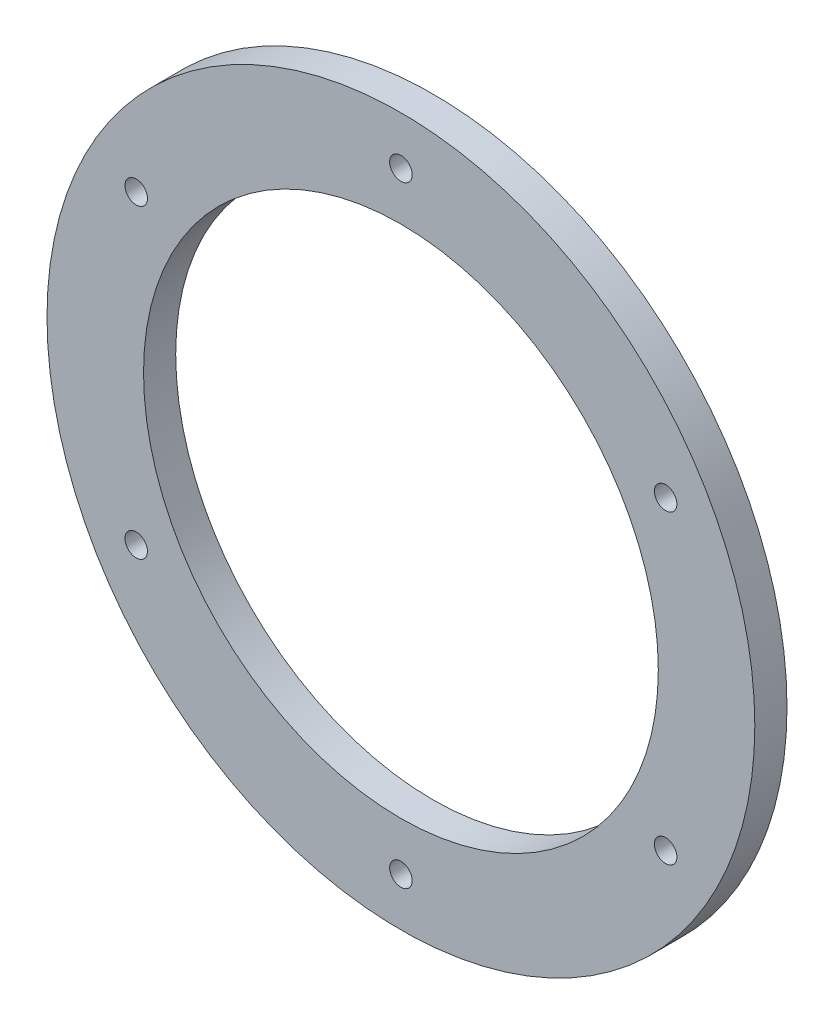
ISO-10303-21;
HEADER;
FILE_DESCRIPTION(('STEP AP214'),'2;1');
FILE_NAME('part.step','',(''),(''),'','','');
FILE_SCHEMA(('AUTOMOTIVE_DESIGN { 1 0 10303 214 1 1 1 1 }'));
ENDSEC;
DATA;
#1=APPLICATION_CONTEXT('core data for automotive mechanical design processes');
#2=APPLICATION_PROTOCOL_DEFINITION('international standard','automotive_design',2000,#1);
#3=PRODUCT_CONTEXT('',#1,'mechanical');
#4=PRODUCT('Part','Part','',(#3));
#5=PRODUCT_RELATED_PRODUCT_CATEGORY('part','',(#4));
#6=PRODUCT_DEFINITION_FORMATION('','',#4);
#7=PRODUCT_DEFINITION_CONTEXT('part definition',#1,'design');
#8=PRODUCT_DEFINITION('design','',#6,#7);
#9=PRODUCT_DEFINITION_SHAPE('','',#8);
#10=(LENGTH_UNIT() NAMED_UNIT(*) SI_UNIT(.MILLI.,.METRE.));
#11=(NAMED_UNIT(*) PLANE_ANGLE_UNIT() SI_UNIT($,.RADIAN.));
#12=(NAMED_UNIT(*) SI_UNIT($,.STERADIAN.) SOLID_ANGLE_UNIT());
#13=UNCERTAINTY_MEASURE_WITH_UNIT(LENGTH_MEASURE(1.E-05),#10,'distance_accuracy_value','');
#14=(GEOMETRIC_REPRESENTATION_CONTEXT(3) GLOBAL_UNCERTAINTY_ASSIGNED_CONTEXT((#13)) GLOBAL_UNIT_ASSIGNED_CONTEXT((#10,
#11,#12)) REPRESENTATION_CONTEXT('',''));
#15=CARTESIAN_POINT('',(0.,0.,0.));
#16=DIRECTION('',(0.,0.,1.));
#17=DIRECTION('',(1.,0.,0.));
#18=AXIS2_PLACEMENT_3D('',#15,#16,#17);
#19=CARTESIAN_POINT('',(0.,0.,5.));
#20=DIRECTION('',(0.,0.,1.));
#21=DIRECTION('',(1.,0.,0.));
#22=AXIS2_PLACEMENT_3D('',#19,#20,#21);
#23=PLANE('',#22);
#24=CARTESIAN_POINT('',(-41.1362066797553,-23.7500000000032,5.));
#25=DIRECTION('',(0.,0.,1.));
#26=DIRECTION('',(1.,0.,0.));
#27=AXIS2_PLACEMENT_3D('',#24,#25,#26);
#28=CIRCLE('',#27,1.75000000000669);
#29=CARTESIAN_POINT('',(-39.3862066797486,-23.7500000000032,5.));
#30=VERTEX_POINT('',#29);
#31=EDGE_CURVE('E72',#30,#30,#28,.T.);
#32=ORIENTED_EDGE('',*,*,#31,.F.);
#33=EDGE_LOOP('',(#32));
#34=FACE_BOUND('',#33,.T.);
#35=CARTESIAN_POINT('',(41.1362066797664,-23.7499999999968,5.));
#36=DIRECTION('',(0.,0.,1.));
#37=DIRECTION('',(1.,0.,0.));
#38=AXIS2_PLACEMENT_3D('',#35,#36,#37);
#39=CIRCLE('',#38,1.7500000000046);
#40=CARTESIAN_POINT('',(42.886206679771,-23.7499999999968,5.));
#41=VERTEX_POINT('',#40);
#42=EDGE_CURVE('E60',#41,#41,#39,.T.);
#43=ORIENTED_EDGE('',*,*,#42,.F.);
#44=EDGE_LOOP('',(#43));
#45=FACE_BOUND('',#44,.T.);
#46=CARTESIAN_POINT('',(0.,47.5,5.));
#47=DIRECTION('',(0.,0.,1.));
#48=DIRECTION('',(1.,0.,0.));
#49=AXIS2_PLACEMENT_3D('',#46,#47,#48);
#50=CIRCLE('',#49,1.75);
#51=CARTESIAN_POINT('',(1.75,47.5,5.));
#52=VERTEX_POINT('',#51);
#53=EDGE_CURVE('E48',#52,#52,#50,.T.);
#54=ORIENTED_EDGE('',*,*,#53,.F.);
#55=EDGE_LOOP('',(#54));
#56=FACE_BOUND('',#55,.T.);
#57=CARTESIAN_POINT('',(0.,0.,5.));
#58=DIRECTION('',(0.,0.,1.));
#59=DIRECTION('',(1.,0.,0.));
#60=AXIS2_PLACEMENT_3D('',#57,#58,#59);
#61=CIRCLE('',#60,55.);
#62=CARTESIAN_POINT('',(55.,0.,5.));
#63=VERTEX_POINT('',#62);
#64=EDGE_CURVE('E10',#63,#63,#61,.T.);
#65=ORIENTED_EDGE('',*,*,#64,.T.);
#66=EDGE_LOOP('',(#65));
#67=FACE_BOUND('',#66,.T.);
#68=CARTESIAN_POINT('',(0.,0.,5.));
#69=DIRECTION('',(0.,0.,1.));
#70=DIRECTION('',(1.,0.,0.));
#71=AXIS2_PLACEMENT_3D('',#68,#69,#70);
#72=CIRCLE('',#71,40.);
#73=CARTESIAN_POINT('',(40.,0.,5.));
#74=VERTEX_POINT('',#73);
#75=EDGE_CURVE('E43',#74,#74,#72,.T.);
#76=ORIENTED_EDGE('',*,*,#75,.F.);
#77=EDGE_LOOP('',(#76));
#78=FACE_BOUND('',#77,.T.);
#79=CARTESIAN_POINT('',(41.1362066797627,23.7500000000032,5.));
#80=DIRECTION('',(0.,0.,1.));
#81=DIRECTION('',(1.,0.,0.));
#82=AXIS2_PLACEMENT_3D('',#79,#80,#81);
#83=CIRCLE('',#82,1.75000000000096);
#84=CARTESIAN_POINT('',(42.8862066797636,23.7500000000032,5.));
#85=VERTEX_POINT('',#84);
#86=EDGE_CURVE('E54',#85,#85,#83,.T.);
#87=ORIENTED_EDGE('',*,*,#86,.F.);
#88=EDGE_LOOP('',(#87));
#89=FACE_BOUND('',#88,.T.);
#90=CARTESIAN_POINT('',(7.4135396122289E-12,-47.5,5.));
#91=DIRECTION('',(0.,0.,1.));
#92=DIRECTION('',(1.,0.,0.));
#93=AXIS2_PLACEMENT_3D('',#90,#91,#92);
#94=CIRCLE('',#93,1.75000000000741);
#95=CARTESIAN_POINT('',(1.75000000001482,-47.5,5.));
#96=VERTEX_POINT('',#95);
#97=EDGE_CURVE('E66',#96,#96,#94,.T.);
#98=ORIENTED_EDGE('',*,*,#97,.F.);
#99=EDGE_LOOP('',(#98));
#100=FACE_BOUND('',#99,.T.);
#101=CARTESIAN_POINT('',(-41.136206679759,23.7499999999968,5.));
#102=DIRECTION('',(0.,0.,1.));
#103=DIRECTION('',(1.,0.,0.));
#104=AXIS2_PLACEMENT_3D('',#101,#102,#103);
#105=CIRCLE('',#104,1.75000000000328);
#106=CARTESIAN_POINT('',(-39.3862066797557,23.7499999999968,5.));
#107=VERTEX_POINT('',#106);
#108=EDGE_CURVE('E78',#107,#107,#105,.T.);
#109=ORIENTED_EDGE('',*,*,#108,.F.);
#110=EDGE_LOOP('',(#109));
#111=FACE_BOUND('',#110,.T.);
#112=ADVANCED_FACE('F32',(#34,#45,#56,#67,#78,#89,#100,#111),#23,.T.);
#113=CARTESIAN_POINT('',(0.,0.,0.));
#114=DIRECTION('',(0.,0.,1.));
#115=DIRECTION('',(1.,0.,0.));
#116=AXIS2_PLACEMENT_3D('',#113,#114,#115);
#117=PLANE('',#116);
#118=CARTESIAN_POINT('',(0.,0.,0.));
#119=DIRECTION('',(0.,0.,1.));
#120=DIRECTION('',(1.,0.,0.));
#121=AXIS2_PLACEMENT_3D('',#118,#119,#120);
#122=CIRCLE('',#121,55.);
#123=CARTESIAN_POINT('',(55.,0.,0.));
#124=VERTEX_POINT('',#123);
#125=EDGE_CURVE('E36',#124,#124,#122,.T.);
#126=ORIENTED_EDGE('',*,*,#125,.F.);
#127=EDGE_LOOP('',(#126));
#128=FACE_BOUND('',#127,.T.);
#129=CARTESIAN_POINT('',(0.,0.,0.));
#130=DIRECTION('',(0.,0.,1.));
#131=DIRECTION('',(1.,0.,0.));
#132=AXIS2_PLACEMENT_3D('',#129,#130,#131);
#133=CIRCLE('',#132,40.);
#134=CARTESIAN_POINT('',(40.,0.,0.));
#135=VERTEX_POINT('',#134);
#136=EDGE_CURVE('E45',#135,#135,#133,.T.);
#137=ORIENTED_EDGE('',*,*,#136,.T.);
#138=EDGE_LOOP('',(#137));
#139=FACE_BOUND('',#138,.T.);
#140=CARTESIAN_POINT('',(0.,47.5,0.));
#141=DIRECTION('',(0.,0.,1.));
#142=DIRECTION('',(1.,0.,0.));
#143=AXIS2_PLACEMENT_3D('',#140,#141,#142);
#144=CIRCLE('',#143,1.75);
#145=CARTESIAN_POINT('',(1.75,47.5,0.));
#146=VERTEX_POINT('',#145);
#147=EDGE_CURVE('E51',#146,#146,#144,.T.);
#148=ORIENTED_EDGE('',*,*,#147,.T.);
#149=EDGE_LOOP('',(#148));
#150=FACE_BOUND('',#149,.T.);
#151=CARTESIAN_POINT('',(41.1362066797627,23.7500000000032,0.));
#152=DIRECTION('',(0.,0.,1.));
#153=DIRECTION('',(1.,0.,0.));
#154=AXIS2_PLACEMENT_3D('',#151,#152,#153);
#155=CIRCLE('',#154,1.75000000000096);
#156=CARTESIAN_POINT('',(42.8862066797636,23.7500000000032,0.));
#157=VERTEX_POINT('',#156);
#158=EDGE_CURVE('E57',#157,#157,#155,.T.);
#159=ORIENTED_EDGE('',*,*,#158,.T.);
#160=EDGE_LOOP('',(#159));
#161=FACE_BOUND('',#160,.T.);
#162=CARTESIAN_POINT('',(41.1362066797664,-23.7499999999968,0.));
#163=DIRECTION('',(0.,0.,1.));
#164=DIRECTION('',(1.,0.,0.));
#165=AXIS2_PLACEMENT_3D('',#162,#163,#164);
#166=CIRCLE('',#165,1.7500000000046);
#167=CARTESIAN_POINT('',(42.886206679771,-23.7499999999968,0.));
#168=VERTEX_POINT('',#167);
#169=EDGE_CURVE('E63',#168,#168,#166,.T.);
#170=ORIENTED_EDGE('',*,*,#169,.T.);
#171=EDGE_LOOP('',(#170));
#172=FACE_BOUND('',#171,.T.);
#173=CARTESIAN_POINT('',(7.4135396122289E-12,-47.5,0.));
#174=DIRECTION('',(0.,0.,1.));
#175=DIRECTION('',(1.,0.,0.));
#176=AXIS2_PLACEMENT_3D('',#173,#174,#175);
#177=CIRCLE('',#176,1.75000000000741);
#178=CARTESIAN_POINT('',(1.75000000001482,-47.5,0.));
#179=VERTEX_POINT('',#178);
#180=EDGE_CURVE('E69',#179,#179,#177,.T.);
#181=ORIENTED_EDGE('',*,*,#180,.T.);
#182=EDGE_LOOP('',(#181));
#183=FACE_BOUND('',#182,.T.);
#184=CARTESIAN_POINT('',(-41.1362066797553,-23.7500000000032,0.));
#185=DIRECTION('',(0.,0.,1.));
#186=DIRECTION('',(1.,0.,0.));
#187=AXIS2_PLACEMENT_3D('',#184,#185,#186);
#188=CIRCLE('',#187,1.75000000000669);
#189=CARTESIAN_POINT('',(-39.3862066797486,-23.7500000000032,0.));
#190=VERTEX_POINT('',#189);
#191=EDGE_CURVE('E75',#190,#190,#188,.T.);
#192=ORIENTED_EDGE('',*,*,#191,.T.);
#193=EDGE_LOOP('',(#192));
#194=FACE_BOUND('',#193,.T.);
#195=CARTESIAN_POINT('',(-41.136206679759,23.7499999999968,0.));
#196=DIRECTION('',(0.,0.,1.));
#197=DIRECTION('',(1.,0.,0.));
#198=AXIS2_PLACEMENT_3D('',#195,#196,#197);
#199=CIRCLE('',#198,1.75000000000328);
#200=CARTESIAN_POINT('',(-39.3862066797557,23.7499999999968,0.));
#201=VERTEX_POINT('',#200);
#202=EDGE_CURVE('E81',#201,#201,#199,.T.);
#203=ORIENTED_EDGE('',*,*,#202,.T.);
#204=EDGE_LOOP('',(#203));
#205=FACE_BOUND('',#204,.T.);
#206=ADVANCED_FACE('F91',(#128,#139,#150,#161,#172,#183,#194,#205),#117,.F.);
#207=CARTESIAN_POINT('',(0.,0.,5.));
#208=DIRECTION('',(0.,0.,-1.));
#209=DIRECTION('',(-1.,0.,0.));
#210=AXIS2_PLACEMENT_3D('',#207,#208,#209);
#211=CYLINDRICAL_SURFACE('',#210,55.);
#212=ORIENTED_EDGE('',*,*,#64,.F.);
#213=EDGE_LOOP('',(#212));
#214=FACE_BOUND('',#213,.T.);
#215=ORIENTED_EDGE('',*,*,#125,.T.);
#216=EDGE_LOOP('',(#215));
#217=FACE_BOUND('',#216,.T.);
#218=ADVANCED_FACE('F34',(#214,#217),#211,.T.);
#219=CARTESIAN_POINT('',(0.,0.,5.));
#220=DIRECTION('',(0.,0.,-1.));
#221=DIRECTION('',(-1.,0.,0.));
#222=AXIS2_PLACEMENT_3D('',#219,#220,#221);
#223=CYLINDRICAL_SURFACE('',#222,40.);
#224=ORIENTED_EDGE('',*,*,#75,.T.);
#225=EDGE_LOOP('',(#224));
#226=FACE_BOUND('',#225,.T.);
#227=ORIENTED_EDGE('',*,*,#136,.F.);
#228=EDGE_LOOP('',(#227));
#229=FACE_BOUND('',#228,.T.);
#230=ADVANCED_FACE('F101',(#226,#229),#223,.F.);
#231=CARTESIAN_POINT('',(0.,47.5,5.));
#232=DIRECTION('',(0.,0.,-1.));
#233=DIRECTION('',(-1.,0.,0.));
#234=AXIS2_PLACEMENT_3D('',#231,#232,#233);
#235=CYLINDRICAL_SURFACE('',#234,1.75);
#236=ORIENTED_EDGE('',*,*,#53,.T.);
#237=EDGE_LOOP('',(#236));
#238=FACE_BOUND('',#237,.T.);
#239=ORIENTED_EDGE('',*,*,#147,.F.);
#240=EDGE_LOOP('',(#239));
#241=FACE_BOUND('',#240,.T.);
#242=ADVANCED_FACE('F104',(#238,#241),#235,.F.);
#243=CARTESIAN_POINT('',(41.1362066797627,23.7500000000032,5.));
#244=DIRECTION('',(0.,0.,-1.));
#245=DIRECTION('',(-1.,0.,0.));
#246=AXIS2_PLACEMENT_3D('',#243,#244,#245);
#247=CYLINDRICAL_SURFACE('',#246,1.75000000000096);
#248=ORIENTED_EDGE('',*,*,#86,.T.);
#249=EDGE_LOOP('',(#248));
#250=FACE_BOUND('',#249,.T.);
#251=ORIENTED_EDGE('',*,*,#158,.F.);
#252=EDGE_LOOP('',(#251));
#253=FACE_BOUND('',#252,.T.);
#254=ADVANCED_FACE('F108',(#250,#253),#247,.F.);
#255=CARTESIAN_POINT('',(41.1362066797664,-23.7499999999968,5.));
#256=DIRECTION('',(0.,0.,-1.));
#257=DIRECTION('',(-1.,0.,0.));
#258=AXIS2_PLACEMENT_3D('',#255,#256,#257);
#259=CYLINDRICAL_SURFACE('',#258,1.7500000000046);
#260=ORIENTED_EDGE('',*,*,#42,.T.);
#261=EDGE_LOOP('',(#260));
#262=FACE_BOUND('',#261,.T.);
#263=ORIENTED_EDGE('',*,*,#169,.F.);
#264=EDGE_LOOP('',(#263));
#265=FACE_BOUND('',#264,.T.);
#266=ADVANCED_FACE('F112',(#262,#265),#259,.F.);
#267=CARTESIAN_POINT('',(7.4135396122289E-12,-47.5,5.));
#268=DIRECTION('',(0.,0.,-1.));
#269=DIRECTION('',(-1.,0.,0.));
#270=AXIS2_PLACEMENT_3D('',#267,#268,#269);
#271=CYLINDRICAL_SURFACE('',#270,1.75000000000741);
#272=ORIENTED_EDGE('',*,*,#97,.T.);
#273=EDGE_LOOP('',(#272));
#274=FACE_BOUND('',#273,.T.);
#275=ORIENTED_EDGE('',*,*,#180,.F.);
#276=EDGE_LOOP('',(#275));
#277=FACE_BOUND('',#276,.T.);
#278=ADVANCED_FACE('F116',(#274,#277),#271,.F.);
#279=CARTESIAN_POINT('',(-41.1362066797553,-23.7500000000032,5.));
#280=DIRECTION('',(0.,0.,-1.));
#281=DIRECTION('',(-1.,0.,0.));
#282=AXIS2_PLACEMENT_3D('',#279,#280,#281);
#283=CYLINDRICAL_SURFACE('',#282,1.75000000000669);
#284=ORIENTED_EDGE('',*,*,#31,.T.);
#285=EDGE_LOOP('',(#284));
#286=FACE_BOUND('',#285,.T.);
#287=ORIENTED_EDGE('',*,*,#191,.F.);
#288=EDGE_LOOP('',(#287));
#289=FACE_BOUND('',#288,.T.);
#290=ADVANCED_FACE('F120',(#286,#289),#283,.F.);
#291=CARTESIAN_POINT('',(-41.136206679759,23.7499999999968,5.));
#292=DIRECTION('',(0.,0.,-1.));
#293=DIRECTION('',(-1.,0.,0.));
#294=AXIS2_PLACEMENT_3D('',#291,#292,#293);
#295=CYLINDRICAL_SURFACE('',#294,1.75000000000328);
#296=ORIENTED_EDGE('',*,*,#108,.T.);
#297=EDGE_LOOP('',(#296));
#298=FACE_BOUND('',#297,.T.);
#299=ORIENTED_EDGE('',*,*,#202,.F.);
#300=EDGE_LOOP('',(#299));
#301=FACE_BOUND('',#300,.T.);
#302=ADVANCED_FACE('F87',(#298,#301),#295,.F.);
#303=CLOSED_SHELL('',(#112,#206,#218,#230,#242,#254,#266,#278,#290,#302));
#304=MANIFOLD_SOLID_BREP('B2',#303);
#305=ADVANCED_BREP_SHAPE_REPRESENTATION('',(#18,#304),#14);
#306=SHAPE_DEFINITION_REPRESENTATION(#9,#305);
ENDSEC;
END-ISO-10303-21;
